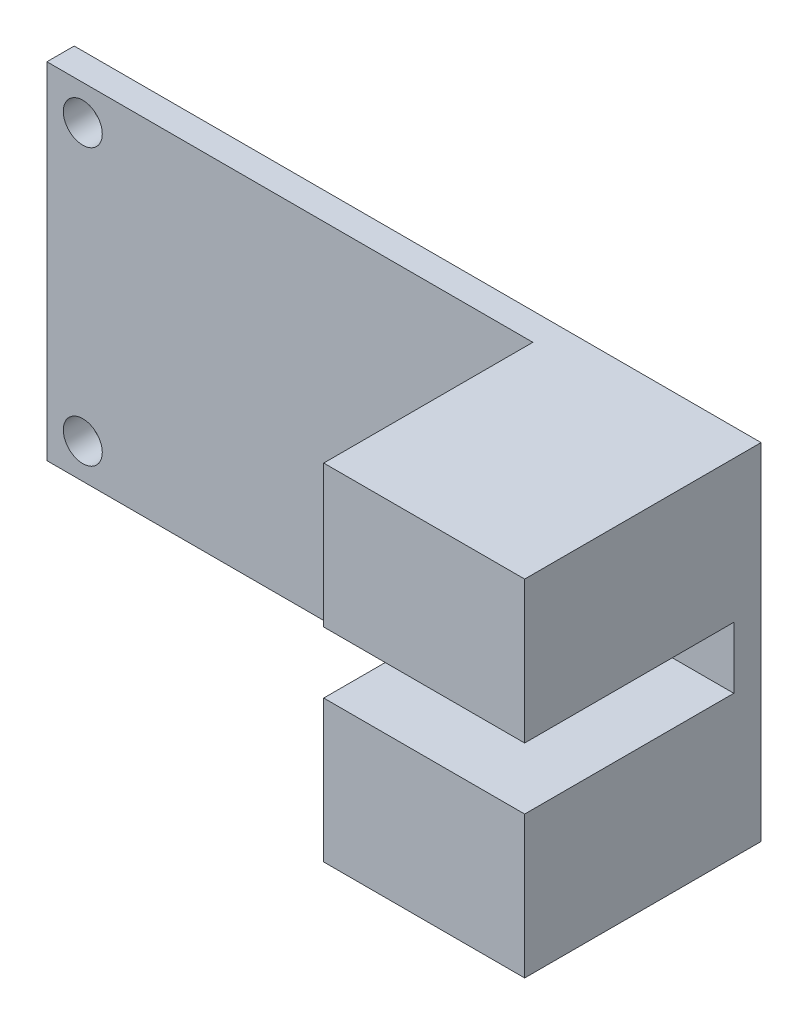
ISO-10303-21;
HEADER;
FILE_DESCRIPTION(('STEP AP214'),'2;1');
FILE_NAME('part.step','',(''),(''),'','','');
FILE_SCHEMA(('AUTOMOTIVE_DESIGN { 1 0 10303 214 1 1 1 1 }'));
ENDSEC;
DATA;
#1=APPLICATION_CONTEXT('core data for automotive mechanical design processes');
#2=APPLICATION_PROTOCOL_DEFINITION('international standard','automotive_design',2000,#1);
#3=PRODUCT_CONTEXT('',#1,'mechanical');
#4=PRODUCT('Part','Part','',(#3));
#5=PRODUCT_RELATED_PRODUCT_CATEGORY('part','',(#4));
#6=PRODUCT_DEFINITION_FORMATION('','',#4);
#7=PRODUCT_DEFINITION_CONTEXT('part definition',#1,'design');
#8=PRODUCT_DEFINITION('design','',#6,#7);
#9=PRODUCT_DEFINITION_SHAPE('','',#8);
#10=(LENGTH_UNIT() NAMED_UNIT(*) SI_UNIT(.MILLI.,.METRE.));
#11=(NAMED_UNIT(*) PLANE_ANGLE_UNIT() SI_UNIT($,.RADIAN.));
#12=(NAMED_UNIT(*) SI_UNIT($,.STERADIAN.) SOLID_ANGLE_UNIT());
#13=UNCERTAINTY_MEASURE_WITH_UNIT(LENGTH_MEASURE(1.E-05),#10,'distance_accuracy_value','');
#14=(GEOMETRIC_REPRESENTATION_CONTEXT(3) GLOBAL_UNCERTAINTY_ASSIGNED_CONTEXT((#13)) GLOBAL_UNIT_ASSIGNED_CONTEXT((#10,
#11,#12)) REPRESENTATION_CONTEXT('',''));
#15=CARTESIAN_POINT('',(0.,0.,0.));
#16=DIRECTION('',(0.,0.,1.));
#17=DIRECTION('',(1.,0.,0.));
#18=AXIS2_PLACEMENT_3D('',#15,#16,#17);
#19=CARTESIAN_POINT('',(0.,0.,1.33));
#20=DIRECTION('',(0.,0.,1.));
#21=DIRECTION('',(1.,0.,0.));
#22=AXIS2_PLACEMENT_3D('',#19,#20,#21);
#23=PLANE('',#22);
#24=CARTESIAN_POINT('',(-15.,-6.725,1.33));
#25=DIRECTION('',(0.,0.,1.));
#26=DIRECTION('',(1.,0.,0.));
#27=AXIS2_PLACEMENT_3D('',#24,#25,#26);
#28=CIRCLE('',#27,0.949999999999999);
#29=CARTESIAN_POINT('',(-14.05,-6.725,1.33));
#30=VERTEX_POINT('',#29);
#31=EDGE_CURVE('E206',#30,#30,#28,.T.);
#32=ORIENTED_EDGE('',*,*,#31,.F.);
#33=EDGE_LOOP('',(#32));
#34=FACE_BOUND('',#33,.T.);
#35=CARTESIAN_POINT('',(-15.,6.725,1.33));
#36=DIRECTION('',(0.,0.,1.));
#37=DIRECTION('',(1.,0.,0.));
#38=AXIS2_PLACEMENT_3D('',#35,#36,#37);
#39=CIRCLE('',#38,0.949999999999999);
#40=CARTESIAN_POINT('',(-14.05,6.725,1.33));
#41=VERTEX_POINT('',#40);
#42=EDGE_CURVE('E198',#41,#41,#39,.T.);
#43=ORIENTED_EDGE('',*,*,#42,.F.);
#44=EDGE_LOOP('',(#43));
#45=FACE_BOUND('',#44,.T.);
#46=DIRECTION('',(0.,-1.,0.));
#47=VECTOR('',#46,1.);
#48=CARTESIAN_POINT('',(6.94999999999999,-8.425,1.33));
#49=LINE('',#48,#47);
#50=CARTESIAN_POINT('',(6.94999999999999,-1.5,1.33));
#51=VERTEX_POINT('',#50);
#52=CARTESIAN_POINT('',(6.94999999999999,-8.425,1.33));
#53=VERTEX_POINT('',#52);
#54=EDGE_CURVE('E61',#51,#53,#49,.T.);
#55=ORIENTED_EDGE('',*,*,#54,.F.);
#56=DIRECTION('',(-1.,0.,0.));
#57=VECTOR('',#56,1.);
#58=CARTESIAN_POINT('',(16.75,-1.5,1.33));
#59=LINE('',#58,#57);
#60=CARTESIAN_POINT('',(16.75,-1.5,1.33));
#61=VERTEX_POINT('',#60);
#62=EDGE_CURVE('E134',#61,#51,#59,.T.);
#63=ORIENTED_EDGE('',*,*,#62,.F.);
#64=DIRECTION('',(0.,1.,0.));
#65=VECTOR('',#64,1.);
#66=CARTESIAN_POINT('',(16.75,-8.425,1.33));
#67=LINE('',#66,#65);
#68=CARTESIAN_POINT('',(16.75,1.5,1.33));
#69=VERTEX_POINT('',#68);
#70=EDGE_CURVE('E122',#61,#69,#67,.T.);
#71=ORIENTED_EDGE('',*,*,#70,.T.);
#72=DIRECTION('',(1.,0.,0.));
#73=VECTOR('',#72,1.);
#74=CARTESIAN_POINT('',(16.75,1.5,1.33));
#75=LINE('',#74,#73);
#76=CARTESIAN_POINT('',(6.94999999999999,1.5,1.33));
#77=VERTEX_POINT('',#76);
#78=EDGE_CURVE('E173',#77,#69,#75,.T.);
#79=ORIENTED_EDGE('',*,*,#78,.F.);
#80=DIRECTION('',(0.,-1.,0.));
#81=VECTOR('',#80,1.);
#82=CARTESIAN_POINT('',(6.94999999999999,8.425,1.33));
#83=LINE('',#82,#81);
#84=CARTESIAN_POINT('',(6.94999999999999,8.425,1.33));
#85=VERTEX_POINT('',#84);
#86=EDGE_CURVE('E139',#85,#77,#83,.T.);
#87=ORIENTED_EDGE('',*,*,#86,.F.);
#88=DIRECTION('',(-1.,0.,0.));
#89=VECTOR('',#88,1.);
#90=CARTESIAN_POINT('',(16.75,8.425,1.33));
#91=LINE('',#90,#89);
#92=CARTESIAN_POINT('',(-16.75,8.425,1.33));
#93=VERTEX_POINT('',#92);
#94=EDGE_CURVE('E132',#85,#93,#91,.T.);
#95=ORIENTED_EDGE('',*,*,#94,.T.);
#96=DIRECTION('',(0.,-1.,0.));
#97=VECTOR('',#96,1.);
#98=CARTESIAN_POINT('',(-16.75,-8.425,1.33));
#99=LINE('',#98,#97);
#100=CARTESIAN_POINT('',(-16.75,-8.425,1.33));
#101=VERTEX_POINT('',#100);
#102=EDGE_CURVE('E214',#93,#101,#99,.T.);
#103=ORIENTED_EDGE('',*,*,#102,.T.);
#104=DIRECTION('',(1.,0.,0.));
#105=VECTOR('',#104,1.);
#106=CARTESIAN_POINT('',(16.75,-8.425,1.33));
#107=LINE('',#106,#105);
#108=EDGE_CURVE('E66',#101,#53,#107,.T.);
#109=ORIENTED_EDGE('',*,*,#108,.T.);
#110=EDGE_LOOP('',(#55,#63,#71,#79,#87,#95,#103,#109));
#111=FACE_BOUND('',#110,.T.);
#112=ADVANCED_FACE('F45',(#34,#45,#111),#23,.T.);
#113=CARTESIAN_POINT('',(0.,0.,0.));
#114=DIRECTION('',(0.,0.,1.));
#115=DIRECTION('',(1.,0.,0.));
#116=AXIS2_PLACEMENT_3D('',#113,#114,#115);
#117=PLANE('',#116);
#118=DIRECTION('',(0.,-1.,0.));
#119=VECTOR('',#118,1.);
#120=CARTESIAN_POINT('',(-16.75,-8.425,0.));
#121=LINE('',#120,#119);
#122=CARTESIAN_POINT('',(-16.75,8.425,0.));
#123=VERTEX_POINT('',#122);
#124=CARTESIAN_POINT('',(-16.75,-8.425,0.));
#125=VERTEX_POINT('',#124);
#126=EDGE_CURVE('E210',#123,#125,#121,.T.);
#127=ORIENTED_EDGE('',*,*,#126,.F.);
#128=DIRECTION('',(-1.,0.,0.));
#129=VECTOR('',#128,1.);
#130=CARTESIAN_POINT('',(16.75,8.425,0.));
#131=LINE('',#130,#129);
#132=CARTESIAN_POINT('',(16.75,8.425,0.));
#133=VERTEX_POINT('',#132);
#134=EDGE_CURVE('E217',#133,#123,#131,.T.);
#135=ORIENTED_EDGE('',*,*,#134,.F.);
#136=DIRECTION('',(0.,1.,0.));
#137=VECTOR('',#136,1.);
#138=CARTESIAN_POINT('',(16.75,-8.425,0.));
#139=LINE('',#138,#137);
#140=CARTESIAN_POINT('',(16.75,-8.425,0.));
#141=VERTEX_POINT('',#140);
#142=EDGE_CURVE('E229',#141,#133,#139,.T.);
#143=ORIENTED_EDGE('',*,*,#142,.F.);
#144=DIRECTION('',(1.,0.,0.));
#145=VECTOR('',#144,1.);
#146=CARTESIAN_POINT('',(16.75,-8.425,0.));
#147=LINE('',#146,#145);
#148=EDGE_CURVE('E226',#125,#141,#147,.T.);
#149=ORIENTED_EDGE('',*,*,#148,.F.);
#150=EDGE_LOOP('',(#127,#135,#143,#149));
#151=FACE_BOUND('',#150,.T.);
#152=CARTESIAN_POINT('',(-15.,-6.725,0.));
#153=DIRECTION('',(0.,0.,1.));
#154=DIRECTION('',(1.,0.,0.));
#155=AXIS2_PLACEMENT_3D('',#152,#153,#154);
#156=CIRCLE('',#155,0.949999999999999);
#157=CARTESIAN_POINT('',(-14.05,-6.725,0.));
#158=VERTEX_POINT('',#157);
#159=EDGE_CURVE('E202',#158,#158,#156,.T.);
#160=ORIENTED_EDGE('',*,*,#159,.T.);
#161=EDGE_LOOP('',(#160));
#162=FACE_BOUND('',#161,.T.);
#163=CARTESIAN_POINT('',(-15.,6.725,0.));
#164=DIRECTION('',(0.,0.,1.));
#165=DIRECTION('',(1.,0.,0.));
#166=AXIS2_PLACEMENT_3D('',#163,#164,#165);
#167=CIRCLE('',#166,0.949999999999999);
#168=CARTESIAN_POINT('',(-14.05,6.725,0.));
#169=VERTEX_POINT('',#168);
#170=EDGE_CURVE('E197',#169,#169,#167,.T.);
#171=ORIENTED_EDGE('',*,*,#170,.T.);
#172=EDGE_LOOP('',(#171));
#173=FACE_BOUND('',#172,.T.);
#174=ADVANCED_FACE('F248',(#151,#162,#173),#117,.F.);
#175=CARTESIAN_POINT('',(-16.75,-8.425,1.33));
#176=DIRECTION('',(1.,0.,0.));
#177=DIRECTION('',(0.,0.,-1.));
#178=AXIS2_PLACEMENT_3D('',#175,#176,#177);
#179=PLANE('',#178);
#180=ORIENTED_EDGE('',*,*,#126,.T.);
#181=DIRECTION('',(0.,0.,-1.));
#182=VECTOR('',#181,1.);
#183=CARTESIAN_POINT('',(-16.75,-8.425,1.33));
#184=LINE('',#183,#182);
#185=EDGE_CURVE('E11',#101,#125,#184,.T.);
#186=ORIENTED_EDGE('',*,*,#185,.F.);
#187=ORIENTED_EDGE('',*,*,#102,.F.);
#188=DIRECTION('',(0.,0.,-1.));
#189=VECTOR('',#188,1.);
#190=CARTESIAN_POINT('',(-16.75,8.425,1.33));
#191=LINE('',#190,#189);
#192=EDGE_CURVE('E222',#93,#123,#191,.T.);
#193=ORIENTED_EDGE('',*,*,#192,.T.);
#194=EDGE_LOOP('',(#180,#186,#187,#193));
#195=FACE_BOUND('',#194,.T.);
#196=ADVANCED_FACE('F47',(#195),#179,.F.);
#197=CARTESIAN_POINT('',(16.75,-8.425,1.33));
#198=DIRECTION('',(0.,1.,0.));
#199=DIRECTION('',(-1.,0.,0.));
#200=AXIS2_PLACEMENT_3D('',#197,#198,#199);
#201=PLANE('',#200);
#202=ORIENTED_EDGE('',*,*,#148,.T.);
#203=DIRECTION('',(0.,0.,-1.));
#204=VECTOR('',#203,1.);
#205=CARTESIAN_POINT('',(16.75,-8.425,1.33));
#206=LINE('',#205,#204);
#207=CARTESIAN_POINT('',(16.75,-8.425,11.53));
#208=VERTEX_POINT('',#207);
#209=EDGE_CURVE('E54',#208,#141,#206,.T.);
#210=ORIENTED_EDGE('',*,*,#209,.F.);
#211=DIRECTION('',(1.,0.,0.));
#212=VECTOR('',#211,1.);
#213=CARTESIAN_POINT('',(16.75,-8.425,11.53));
#214=LINE('',#213,#212);
#215=CARTESIAN_POINT('',(6.94999999999999,-8.425,11.53));
#216=VERTEX_POINT('',#215);
#217=EDGE_CURVE('E154',#216,#208,#214,.T.);
#218=ORIENTED_EDGE('',*,*,#217,.F.);
#219=DIRECTION('',(0.,0.,-1.));
#220=VECTOR('',#219,1.);
#221=CARTESIAN_POINT('',(6.94999999999999,-8.425,11.53));
#222=LINE('',#221,#220);
#223=EDGE_CURVE('E148',#216,#53,#222,.T.);
#224=ORIENTED_EDGE('',*,*,#223,.T.);
#225=ORIENTED_EDGE('',*,*,#108,.F.);
#226=ORIENTED_EDGE('',*,*,#185,.T.);
#227=EDGE_LOOP('',(#202,#210,#218,#224,#225,#226));
#228=FACE_BOUND('',#227,.T.);
#229=ADVANCED_FACE('F295',(#228),#201,.F.);
#230=CARTESIAN_POINT('',(16.75,-8.425,1.33));
#231=DIRECTION('',(-1.,0.,0.));
#232=DIRECTION('',(0.,0.,1.));
#233=AXIS2_PLACEMENT_3D('',#230,#231,#232);
#234=PLANE('',#233);
#235=ORIENTED_EDGE('',*,*,#142,.T.);
#236=DIRECTION('',(0.,0.,-1.));
#237=VECTOR('',#236,1.);
#238=CARTESIAN_POINT('',(16.75,8.425,1.33));
#239=LINE('',#238,#237);
#240=CARTESIAN_POINT('',(16.75,8.425,11.53));
#241=VERTEX_POINT('',#240);
#242=EDGE_CURVE('E237',#241,#133,#239,.T.);
#243=ORIENTED_EDGE('',*,*,#242,.F.);
#244=DIRECTION('',(0.,1.,0.));
#245=VECTOR('',#244,1.);
#246=CARTESIAN_POINT('',(16.75,8.425,11.53));
#247=LINE('',#246,#245);
#248=CARTESIAN_POINT('',(16.75,1.5,11.53));
#249=VERTEX_POINT('',#248);
#250=EDGE_CURVE('E168',#249,#241,#247,.T.);
#251=ORIENTED_EDGE('',*,*,#250,.F.);
#252=DIRECTION('',(0.,0.,-1.));
#253=VECTOR('',#252,1.);
#254=CARTESIAN_POINT('',(16.75,1.5,11.53));
#255=LINE('',#254,#253);
#256=EDGE_CURVE('E129',#249,#69,#255,.T.);
#257=ORIENTED_EDGE('',*,*,#256,.T.);
#258=ORIENTED_EDGE('',*,*,#70,.F.);
#259=DIRECTION('',(0.,0.,-1.));
#260=VECTOR('',#259,1.);
#261=CARTESIAN_POINT('',(16.75,-1.5,11.53));
#262=LINE('',#261,#260);
#263=CARTESIAN_POINT('',(16.75,-1.5,11.53));
#264=VERTEX_POINT('',#263);
#265=EDGE_CURVE('E126',#264,#61,#262,.T.);
#266=ORIENTED_EDGE('',*,*,#265,.F.);
#267=DIRECTION('',(0.,1.,0.));
#268=VECTOR('',#267,1.);
#269=CARTESIAN_POINT('',(16.75,-8.425,11.53));
#270=LINE('',#269,#268);
#271=EDGE_CURVE('E156',#208,#264,#270,.T.);
#272=ORIENTED_EDGE('',*,*,#271,.F.);
#273=ORIENTED_EDGE('',*,*,#209,.T.);
#274=EDGE_LOOP('',(#235,#243,#251,#257,#258,#266,#272,#273));
#275=FACE_BOUND('',#274,.T.);
#276=ADVANCED_FACE('F123',(#275),#234,.F.);
#277=CARTESIAN_POINT('',(16.75,8.425,1.33));
#278=DIRECTION('',(0.,-1.,0.));
#279=DIRECTION('',(1.,0.,0.));
#280=AXIS2_PLACEMENT_3D('',#277,#278,#279);
#281=PLANE('',#280);
#282=ORIENTED_EDGE('',*,*,#134,.T.);
#283=ORIENTED_EDGE('',*,*,#192,.F.);
#284=ORIENTED_EDGE('',*,*,#94,.F.);
#285=DIRECTION('',(0.,0.,-1.));
#286=VECTOR('',#285,1.);
#287=CARTESIAN_POINT('',(6.94999999999999,8.425,11.53));
#288=LINE('',#287,#286);
#289=CARTESIAN_POINT('',(6.94999999999999,8.425,11.53));
#290=VERTEX_POINT('',#289);
#291=EDGE_CURVE('E193',#290,#85,#288,.T.);
#292=ORIENTED_EDGE('',*,*,#291,.F.);
#293=DIRECTION('',(-1.,0.,0.));
#294=VECTOR('',#293,1.);
#295=CARTESIAN_POINT('',(16.75,8.425,11.53));
#296=LINE('',#295,#294);
#297=EDGE_CURVE('E172',#241,#290,#296,.T.);
#298=ORIENTED_EDGE('',*,*,#297,.F.);
#299=ORIENTED_EDGE('',*,*,#242,.T.);
#300=EDGE_LOOP('',(#282,#283,#284,#292,#298,#299));
#301=FACE_BOUND('',#300,.T.);
#302=ADVANCED_FACE('F252',(#301),#281,.F.);
#303=CARTESIAN_POINT('',(-15.,-6.725,1.33));
#304=DIRECTION('',(0.,0.,-1.));
#305=DIRECTION('',(-1.,0.,0.));
#306=AXIS2_PLACEMENT_3D('',#303,#304,#305);
#307=CYLINDRICAL_SURFACE('',#306,0.949999999999999);
#308=ORIENTED_EDGE('',*,*,#31,.T.);
#309=EDGE_LOOP('',(#308));
#310=FACE_BOUND('',#309,.T.);
#311=ORIENTED_EDGE('',*,*,#159,.F.);
#312=EDGE_LOOP('',(#311));
#313=FACE_BOUND('',#312,.T.);
#314=ADVANCED_FACE('F289',(#310,#313),#307,.F.);
#315=CARTESIAN_POINT('',(-15.,6.725,1.33));
#316=DIRECTION('',(0.,0.,-1.));
#317=DIRECTION('',(-1.,0.,0.));
#318=AXIS2_PLACEMENT_3D('',#315,#316,#317);
#319=CYLINDRICAL_SURFACE('',#318,0.949999999999999);
#320=ORIENTED_EDGE('',*,*,#42,.T.);
#321=EDGE_LOOP('',(#320));
#322=FACE_BOUND('',#321,.T.);
#323=ORIENTED_EDGE('',*,*,#170,.F.);
#324=EDGE_LOOP('',(#323));
#325=FACE_BOUND('',#324,.T.);
#326=ADVANCED_FACE('F275',(#322,#325),#319,.F.);
#327=CARTESIAN_POINT('',(6.94999999999999,8.425,11.53));
#328=DIRECTION('',(1.,0.,0.));
#329=DIRECTION('',(0.,1.,0.));
#330=AXIS2_PLACEMENT_3D('',#327,#328,#329);
#331=PLANE('',#330);
#332=ORIENTED_EDGE('',*,*,#86,.T.);
#333=DIRECTION('',(0.,0.,-1.));
#334=VECTOR('',#333,1.);
#335=CARTESIAN_POINT('',(6.94999999999999,1.5,11.53));
#336=LINE('',#335,#334);
#337=CARTESIAN_POINT('',(6.94999999999999,1.5,11.53));
#338=VERTEX_POINT('',#337);
#339=EDGE_CURVE('E189',#338,#77,#336,.T.);
#340=ORIENTED_EDGE('',*,*,#339,.F.);
#341=DIRECTION('',(0.,-1.,0.));
#342=VECTOR('',#341,1.);
#343=CARTESIAN_POINT('',(6.94999999999999,8.425,11.53));
#344=LINE('',#343,#342);
#345=EDGE_CURVE('E176',#290,#338,#344,.T.);
#346=ORIENTED_EDGE('',*,*,#345,.F.);
#347=ORIENTED_EDGE('',*,*,#291,.T.);
#348=EDGE_LOOP('',(#332,#340,#346,#347));
#349=FACE_BOUND('',#348,.T.);
#350=ADVANCED_FACE('F261',(#349),#331,.F.);
#351=CARTESIAN_POINT('',(16.75,1.5,11.53));
#352=DIRECTION('',(0.,1.,0.));
#353=DIRECTION('',(-1.,0.,0.));
#354=AXIS2_PLACEMENT_3D('',#351,#352,#353);
#355=PLANE('',#354);
#356=ORIENTED_EDGE('',*,*,#78,.T.);
#357=ORIENTED_EDGE('',*,*,#256,.F.);
#358=DIRECTION('',(1.,0.,0.));
#359=VECTOR('',#358,1.);
#360=CARTESIAN_POINT('',(16.75,1.5,11.53));
#361=LINE('',#360,#359);
#362=EDGE_CURVE('E179',#338,#249,#361,.T.);
#363=ORIENTED_EDGE('',*,*,#362,.F.);
#364=ORIENTED_EDGE('',*,*,#339,.T.);
#365=EDGE_LOOP('',(#356,#357,#363,#364));
#366=FACE_BOUND('',#365,.T.);
#367=ADVANCED_FACE('F267',(#366),#355,.F.);
#368=CARTESIAN_POINT('',(0.,0.,11.53));
#369=DIRECTION('',(0.,0.,-1.));
#370=DIRECTION('',(-1.,0.,0.));
#371=AXIS2_PLACEMENT_3D('',#368,#369,#370);
#372=PLANE('',#371);
#373=ORIENTED_EDGE('',*,*,#250,.T.);
#374=ORIENTED_EDGE('',*,*,#297,.T.);
#375=ORIENTED_EDGE('',*,*,#345,.T.);
#376=ORIENTED_EDGE('',*,*,#362,.T.);
#377=EDGE_LOOP('',(#373,#374,#375,#376));
#378=FACE_BOUND('',#377,.T.);
#379=ADVANCED_FACE('F265',(#378),#372,.F.);
#380=CARTESIAN_POINT('',(16.75,-1.5,11.53));
#381=DIRECTION('',(0.,-1.,0.));
#382=DIRECTION('',(1.,0.,0.));
#383=AXIS2_PLACEMENT_3D('',#380,#381,#382);
#384=PLANE('',#383);
#385=ORIENTED_EDGE('',*,*,#62,.T.);
#386=DIRECTION('',(0.,0.,-1.));
#387=VECTOR('',#386,1.);
#388=CARTESIAN_POINT('',(6.94999999999999,-1.5,11.53));
#389=LINE('',#388,#387);
#390=CARTESIAN_POINT('',(6.94999999999999,-1.5,11.53));
#391=VERTEX_POINT('',#390);
#392=EDGE_CURVE('E145',#391,#51,#389,.T.);
#393=ORIENTED_EDGE('',*,*,#392,.F.);
#394=DIRECTION('',(-1.,0.,0.));
#395=VECTOR('',#394,1.);
#396=CARTESIAN_POINT('',(16.75,-1.5,11.53));
#397=LINE('',#396,#395);
#398=EDGE_CURVE('E142',#264,#391,#397,.T.);
#399=ORIENTED_EDGE('',*,*,#398,.F.);
#400=ORIENTED_EDGE('',*,*,#265,.T.);
#401=EDGE_LOOP('',(#385,#393,#399,#400));
#402=FACE_BOUND('',#401,.T.);
#403=ADVANCED_FACE('F141',(#402),#384,.F.);
#404=CARTESIAN_POINT('',(6.94999999999999,-8.425,11.53));
#405=DIRECTION('',(1.,0.,0.));
#406=DIRECTION('',(0.,1.,0.));
#407=AXIS2_PLACEMENT_3D('',#404,#405,#406);
#408=PLANE('',#407);
#409=ORIENTED_EDGE('',*,*,#54,.T.);
#410=ORIENTED_EDGE('',*,*,#223,.F.);
#411=DIRECTION('',(0.,-1.,0.));
#412=VECTOR('',#411,1.);
#413=CARTESIAN_POINT('',(6.94999999999999,-8.425,11.53));
#414=LINE('',#413,#412);
#415=EDGE_CURVE('E161',#391,#216,#414,.T.);
#416=ORIENTED_EDGE('',*,*,#415,.F.);
#417=ORIENTED_EDGE('',*,*,#392,.T.);
#418=EDGE_LOOP('',(#409,#410,#416,#417));
#419=FACE_BOUND('',#418,.T.);
#420=ADVANCED_FACE('F302',(#419),#408,.F.);
#421=CARTESIAN_POINT('',(0.,0.,11.53));
#422=DIRECTION('',(0.,0.,1.));
#423=DIRECTION('',(1.,0.,0.));
#424=AXIS2_PLACEMENT_3D('',#421,#422,#423);
#425=PLANE('',#424);
#426=ORIENTED_EDGE('',*,*,#271,.T.);
#427=ORIENTED_EDGE('',*,*,#398,.T.);
#428=ORIENTED_EDGE('',*,*,#415,.T.);
#429=ORIENTED_EDGE('',*,*,#217,.T.);
#430=EDGE_LOOP('',(#426,#427,#428,#429));
#431=FACE_BOUND('',#430,.T.);
#432=ADVANCED_FACE('F304',(#431),#425,.T.);
#433=CLOSED_SHELL('',(#112,#174,#196,#229,#276,#302,#314,#326,#350,#367,#379,#403,#420,#432));
#434=MANIFOLD_SOLID_BREP('B2',#433);
#435=ADVANCED_BREP_SHAPE_REPRESENTATION('',(#18,#434),#14);
#436=SHAPE_DEFINITION_REPRESENTATION(#9,#435);
ENDSEC;
END-ISO-10303-21;
